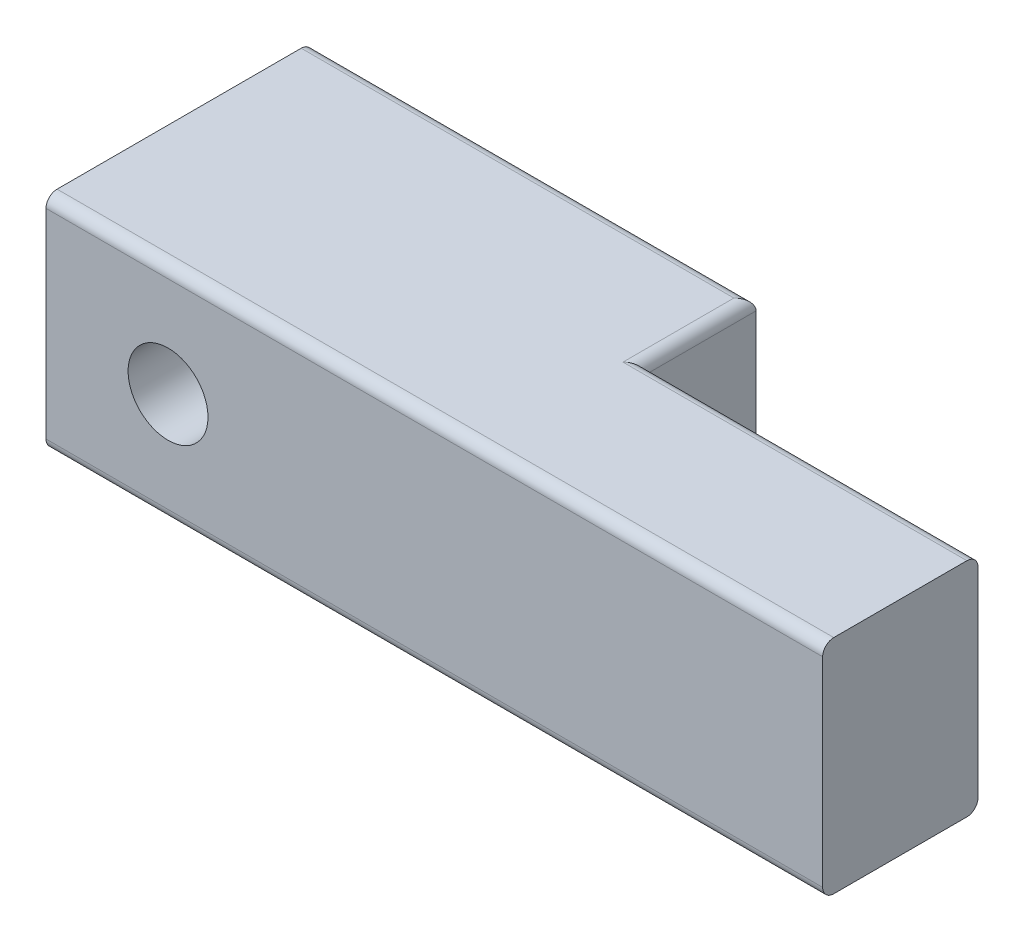
ISO-10303-21;
HEADER;
FILE_DESCRIPTION(('STEP AP214'),'2;1');
FILE_NAME('part.step','',(''),(''),'','','');
FILE_SCHEMA(('AUTOMOTIVE_DESIGN { 1 0 10303 214 1 1 1 1 }'));
ENDSEC;
DATA;
#1=APPLICATION_CONTEXT('core data for automotive mechanical design processes');
#2=APPLICATION_PROTOCOL_DEFINITION('international standard','automotive_design',2000,#1);
#3=PRODUCT_CONTEXT('',#1,'mechanical');
#4=PRODUCT('Part','Part','',(#3));
#5=PRODUCT_RELATED_PRODUCT_CATEGORY('part','',(#4));
#6=PRODUCT_DEFINITION_FORMATION('','',#4);
#7=PRODUCT_DEFINITION_CONTEXT('part definition',#1,'design');
#8=PRODUCT_DEFINITION('design','',#6,#7);
#9=PRODUCT_DEFINITION_SHAPE('','',#8);
#10=(LENGTH_UNIT() NAMED_UNIT(*) SI_UNIT(.MILLI.,.METRE.));
#11=(NAMED_UNIT(*) PLANE_ANGLE_UNIT() SI_UNIT($,.RADIAN.));
#12=(NAMED_UNIT(*) SI_UNIT($,.STERADIAN.) SOLID_ANGLE_UNIT());
#13=UNCERTAINTY_MEASURE_WITH_UNIT(LENGTH_MEASURE(1.E-05),#10,'distance_accuracy_value','');
#14=(GEOMETRIC_REPRESENTATION_CONTEXT(3) GLOBAL_UNCERTAINTY_ASSIGNED_CONTEXT((#13)) GLOBAL_UNIT_ASSIGNED_CONTEXT((#10,
#11,#12)) REPRESENTATION_CONTEXT('',''));
#15=CARTESIAN_POINT('',(0.,0.,0.));
#16=DIRECTION('',(0.,0.,1.));
#17=DIRECTION('',(1.,0.,0.));
#18=AXIS2_PLACEMENT_3D('',#15,#16,#17);
#19=CARTESIAN_POINT('',(17.5,-5.,7.));
#20=DIRECTION('',(-1.,0.,0.));
#21=DIRECTION('',(0.,0.,1.));
#22=AXIS2_PLACEMENT_3D('',#19,#20,#21);
#23=PLANE('',#22);
#24=DIRECTION('',(0.,1.,0.));
#25=VECTOR('',#24,1.);
#26=CARTESIAN_POINT('',(17.5,-5.,0.));
#27=LINE('',#26,#25);
#28=CARTESIAN_POINT('',(17.5,-4.5,0.));
#29=VERTEX_POINT('',#28);
#30=CARTESIAN_POINT('',(17.5,4.5,0.));
#31=VERTEX_POINT('',#30);
#32=EDGE_CURVE('E205',#29,#31,#27,.T.);
#33=ORIENTED_EDGE('',*,*,#32,.T.);
#34=CARTESIAN_POINT('',(17.5,4.5,0.5));
#35=DIRECTION('',(-1.,0.,0.));
#36=DIRECTION('',(0.,0.,1.));
#37=AXIS2_PLACEMENT_3D('',#34,#35,#36);
#38=CIRCLE('',#37,0.5);
#39=CARTESIAN_POINT('',(17.5,5.,0.5));
#40=VERTEX_POINT('',#39);
#41=EDGE_CURVE('E269',#31,#40,#38,.F.);
#42=ORIENTED_EDGE('',*,*,#41,.T.);
#43=DIRECTION('',(0.,0.,-1.));
#44=VECTOR('',#43,1.);
#45=CARTESIAN_POINT('',(17.5,5.,7.));
#46=LINE('',#45,#44);
#47=CARTESIAN_POINT('',(17.5,5.,6.5));
#48=VERTEX_POINT('',#47);
#49=EDGE_CURVE('E145',#48,#40,#46,.T.);
#50=ORIENTED_EDGE('',*,*,#49,.F.);
#51=CARTESIAN_POINT('',(17.5,4.5,6.5));
#52=DIRECTION('',(-1.,0.,0.));
#53=DIRECTION('',(0.,0.,1.));
#54=AXIS2_PLACEMENT_3D('',#51,#52,#53);
#55=CIRCLE('',#54,0.5);
#56=CARTESIAN_POINT('',(17.5,4.5,7.));
#57=VERTEX_POINT('',#56);
#58=EDGE_CURVE('E260',#48,#57,#55,.F.);
#59=ORIENTED_EDGE('',*,*,#58,.T.);
#60=DIRECTION('',(0.,1.,0.));
#61=VECTOR('',#60,1.);
#62=CARTESIAN_POINT('',(17.5,-5.,7.));
#63=LINE('',#62,#61);
#64=CARTESIAN_POINT('',(17.5,-4.5,7.));
#65=VERTEX_POINT('',#64);
#66=EDGE_CURVE('E209',#65,#57,#63,.T.);
#67=ORIENTED_EDGE('',*,*,#66,.F.);
#68=CARTESIAN_POINT('',(17.5,-4.5,6.5));
#69=DIRECTION('',(-1.,0.,0.));
#70=DIRECTION('',(0.,0.,1.));
#71=AXIS2_PLACEMENT_3D('',#68,#69,#70);
#72=CIRCLE('',#71,0.5);
#73=CARTESIAN_POINT('',(17.5,-5.,6.5));
#74=VERTEX_POINT('',#73);
#75=EDGE_CURVE('E263',#65,#74,#72,.F.);
#76=ORIENTED_EDGE('',*,*,#75,.T.);
#77=DIRECTION('',(0.,0.,-1.));
#78=VECTOR('',#77,1.);
#79=CARTESIAN_POINT('',(17.5,-5.,7.));
#80=LINE('',#79,#78);
#81=CARTESIAN_POINT('',(17.5,-5.,0.5));
#82=VERTEX_POINT('',#81);
#83=EDGE_CURVE('E141',#74,#82,#80,.T.);
#84=ORIENTED_EDGE('',*,*,#83,.T.);
#85=CARTESIAN_POINT('',(17.5,-4.5,0.5));
#86=DIRECTION('',(-1.,0.,0.));
#87=DIRECTION('',(0.,0.,1.));
#88=AXIS2_PLACEMENT_3D('',#85,#86,#87);
#89=CIRCLE('',#88,0.5);
#90=EDGE_CURVE('E266',#82,#29,#89,.F.);
#91=ORIENTED_EDGE('',*,*,#90,.T.);
#92=EDGE_LOOP('',(#33,#42,#50,#59,#67,#76,#84,#91));
#93=FACE_BOUND('',#92,.T.);
#94=ADVANCED_FACE('F39',(#93),#23,.F.);
#95=CARTESIAN_POINT('',(-17.5,5.,7.));
#96=DIRECTION('',(0.,-1.,0.));
#97=DIRECTION('',(0.,0.,-1.));
#98=AXIS2_PLACEMENT_3D('',#95,#96,#97);
#99=PLANE('',#98);
#100=ORIENTED_EDGE('',*,*,#49,.T.);
#101=DIRECTION('',(-1.,0.,0.));
#102=VECTOR('',#101,1.);
#103=CARTESIAN_POINT('',(2.5,5.,0.5));
#104=LINE('',#103,#102);
#105=CARTESIAN_POINT('',(2.,5.,0.5));
#106=VERTEX_POINT('',#105);
#107=EDGE_CURVE('E251',#40,#106,#104,.T.);
#108=ORIENTED_EDGE('',*,*,#107,.T.);
#109=DIRECTION('',(0.,0.,1.));
#110=VECTOR('',#109,1.);
#111=CARTESIAN_POINT('',(1.99999999999999,5.,7.));
#112=LINE('',#111,#110);
#113=CARTESIAN_POINT('',(2.,5.,-4.5));
#114=VERTEX_POINT('',#113);
#115=EDGE_CURVE('E248',#106,#114,#112,.F.);
#116=ORIENTED_EDGE('',*,*,#115,.T.);
#117=DIRECTION('',(1.,0.,0.));
#118=VECTOR('',#117,1.);
#119=CARTESIAN_POINT('',(-17.5,5.,-4.5));
#120=LINE('',#119,#118);
#121=CARTESIAN_POINT('',(-17.5,5.,-4.5));
#122=VERTEX_POINT('',#121);
#123=EDGE_CURVE('E245',#114,#122,#120,.F.);
#124=ORIENTED_EDGE('',*,*,#123,.T.);
#125=DIRECTION('',(0.,0.,-1.));
#126=VECTOR('',#125,1.);
#127=CARTESIAN_POINT('',(-17.5,5.,7.));
#128=LINE('',#127,#126);
#129=CARTESIAN_POINT('',(-17.5,5.,6.5));
#130=VERTEX_POINT('',#129);
#131=EDGE_CURVE('E152',#130,#122,#128,.T.);
#132=ORIENTED_EDGE('',*,*,#131,.F.);
#133=DIRECTION('',(-1.,0.,0.));
#134=VECTOR('',#133,1.);
#135=CARTESIAN_POINT('',(-17.5,5.,6.5));
#136=LINE('',#135,#134);
#137=EDGE_CURVE('E242',#130,#48,#136,.F.);
#138=ORIENTED_EDGE('',*,*,#137,.T.);
#139=EDGE_LOOP('',(#100,#108,#116,#124,#132,#138));
#140=FACE_BOUND('',#139,.T.);
#141=ADVANCED_FACE('F312',(#140),#99,.F.);
#142=CARTESIAN_POINT('',(-17.5,-5.,7.));
#143=DIRECTION('',(1.,0.,0.));
#144=DIRECTION('',(0.,0.,-1.));
#145=AXIS2_PLACEMENT_3D('',#142,#143,#144);
#146=PLANE('',#145);
#147=DIRECTION('',(0.,1.,0.));
#148=VECTOR('',#147,1.);
#149=CARTESIAN_POINT('',(-17.5,5.,-5.));
#150=LINE('',#149,#148);
#151=CARTESIAN_POINT('',(-17.5,-4.5,-5.));
#152=VERTEX_POINT('',#151);
#153=CARTESIAN_POINT('',(-17.5,4.5,-5.));
#154=VERTEX_POINT('',#153);
#155=EDGE_CURVE('E197',#152,#154,#150,.T.);
#156=ORIENTED_EDGE('',*,*,#155,.F.);
#157=CARTESIAN_POINT('',(-17.5,-4.5,-4.5));
#158=DIRECTION('',(1.,0.,0.));
#159=DIRECTION('',(0.,0.,-1.));
#160=AXIS2_PLACEMENT_3D('',#157,#158,#159);
#161=CIRCLE('',#160,0.5);
#162=CARTESIAN_POINT('',(-17.5,-5.,-4.5));
#163=VERTEX_POINT('',#162);
#164=EDGE_CURVE('E150',#152,#163,#161,.F.);
#165=ORIENTED_EDGE('',*,*,#164,.T.);
#166=DIRECTION('',(0.,0.,-1.));
#167=VECTOR('',#166,1.);
#168=CARTESIAN_POINT('',(-17.5,-5.,7.));
#169=LINE('',#168,#167);
#170=CARTESIAN_POINT('',(-17.5,-5.,6.5));
#171=VERTEX_POINT('',#170);
#172=EDGE_CURVE('E138',#171,#163,#169,.T.);
#173=ORIENTED_EDGE('',*,*,#172,.F.);
#174=CARTESIAN_POINT('',(-17.5,-4.5,6.5));
#175=DIRECTION('',(1.,0.,0.));
#176=DIRECTION('',(0.,0.,-1.));
#177=AXIS2_PLACEMENT_3D('',#174,#175,#176);
#178=CIRCLE('',#177,0.5);
#179=CARTESIAN_POINT('',(-17.5,-4.5,7.));
#180=VERTEX_POINT('',#179);
#181=EDGE_CURVE('E57',#171,#180,#178,.F.);
#182=ORIENTED_EDGE('',*,*,#181,.T.);
#183=DIRECTION('',(0.,-1.,0.));
#184=VECTOR('',#183,1.);
#185=CARTESIAN_POINT('',(-17.5,-5.,7.));
#186=LINE('',#185,#184);
#187=CARTESIAN_POINT('',(-17.5,4.5,7.));
#188=VERTEX_POINT('',#187);
#189=EDGE_CURVE('E213',#188,#180,#186,.T.);
#190=ORIENTED_EDGE('',*,*,#189,.F.);
#191=CARTESIAN_POINT('',(-17.5,4.5,6.5));
#192=DIRECTION('',(1.,0.,0.));
#193=DIRECTION('',(0.,0.,-1.));
#194=AXIS2_PLACEMENT_3D('',#191,#192,#193);
#195=CIRCLE('',#194,0.5);
#196=EDGE_CURVE('E65',#188,#130,#195,.F.);
#197=ORIENTED_EDGE('',*,*,#196,.T.);
#198=ORIENTED_EDGE('',*,*,#131,.T.);
#199=CARTESIAN_POINT('',(-17.5,4.5,-4.5));
#200=DIRECTION('',(1.,0.,0.));
#201=DIRECTION('',(0.,0.,-1.));
#202=AXIS2_PLACEMENT_3D('',#199,#200,#201);
#203=CIRCLE('',#202,0.5);
#204=EDGE_CURVE('E157',#122,#154,#203,.F.);
#205=ORIENTED_EDGE('',*,*,#204,.T.);
#206=EDGE_LOOP('',(#156,#165,#173,#182,#190,#197,#198,#205));
#207=FACE_BOUND('',#206,.T.);
#208=ADVANCED_FACE('F148',(#207),#146,.F.);
#209=CARTESIAN_POINT('',(-17.5,-5.,7.));
#210=DIRECTION('',(0.,1.,0.));
#211=DIRECTION('',(0.,0.,1.));
#212=AXIS2_PLACEMENT_3D('',#209,#210,#211);
#213=PLANE('',#212);
#214=DIRECTION('',(0.,0.,1.));
#215=VECTOR('',#214,1.);
#216=CARTESIAN_POINT('',(1.99999999999999,-5.,7.));
#217=LINE('',#216,#215);
#218=CARTESIAN_POINT('',(1.99999999999999,-5.,-4.5));
#219=VERTEX_POINT('',#218);
#220=CARTESIAN_POINT('',(1.99999999999999,-5.,0.5));
#221=VERTEX_POINT('',#220);
#222=EDGE_CURVE('E229',#219,#221,#217,.T.);
#223=ORIENTED_EDGE('',*,*,#222,.T.);
#224=DIRECTION('',(1.,0.,0.));
#225=VECTOR('',#224,1.);
#226=CARTESIAN_POINT('',(17.5,-5.,0.5));
#227=LINE('',#226,#225);
#228=EDGE_CURVE('E232',#221,#82,#227,.T.);
#229=ORIENTED_EDGE('',*,*,#228,.T.);
#230=ORIENTED_EDGE('',*,*,#83,.F.);
#231=DIRECTION('',(1.,0.,0.));
#232=VECTOR('',#231,1.);
#233=CARTESIAN_POINT('',(-17.5,-5.,6.5));
#234=LINE('',#233,#232);
#235=EDGE_CURVE('E135',#74,#171,#234,.F.);
#236=ORIENTED_EDGE('',*,*,#235,.T.);
#237=ORIENTED_EDGE('',*,*,#172,.T.);
#238=DIRECTION('',(-1.,0.,0.));
#239=VECTOR('',#238,1.);
#240=CARTESIAN_POINT('',(-17.5,-5.,-4.5));
#241=LINE('',#240,#239);
#242=EDGE_CURVE('E144',#163,#219,#241,.F.);
#243=ORIENTED_EDGE('',*,*,#242,.T.);
#244=EDGE_LOOP('',(#223,#229,#230,#236,#237,#243));
#245=FACE_BOUND('',#244,.T.);
#246=ADVANCED_FACE('F137',(#245),#213,.F.);
#247=CARTESIAN_POINT('',(0.,0.,7.));
#248=DIRECTION('',(0.,0.,-1.));
#249=DIRECTION('',(-1.,0.,0.));
#250=AXIS2_PLACEMENT_3D('',#247,#248,#249);
#251=PLANE('',#250);
#252=CARTESIAN_POINT('',(-12.,0.,7.));
#253=DIRECTION('',(0.,0.,1.));
#254=DIRECTION('',(1.,0.,0.));
#255=AXIS2_PLACEMENT_3D('',#252,#253,#254);
#256=CIRCLE('',#255,1.8);
#257=CARTESIAN_POINT('',(-10.2,0.,7.));
#258=VERTEX_POINT('',#257);
#259=EDGE_CURVE('E189',#258,#258,#256,.T.);
#260=ORIENTED_EDGE('',*,*,#259,.F.);
#261=EDGE_LOOP('',(#260));
#262=FACE_BOUND('',#261,.T.);
#263=ORIENTED_EDGE('',*,*,#189,.T.);
#264=DIRECTION('',(1.,0.,0.));
#265=VECTOR('',#264,1.);
#266=CARTESIAN_POINT('',(0.,-4.5,7.));
#267=LINE('',#266,#265);
#268=EDGE_CURVE('E11',#180,#65,#267,.T.);
#269=ORIENTED_EDGE('',*,*,#268,.T.);
#270=ORIENTED_EDGE('',*,*,#66,.T.);
#271=DIRECTION('',(-1.,0.,0.));
#272=VECTOR('',#271,1.);
#273=CARTESIAN_POINT('',(0.,4.5,7.));
#274=LINE('',#273,#272);
#275=EDGE_CURVE('E49',#57,#188,#274,.T.);
#276=ORIENTED_EDGE('',*,*,#275,.T.);
#277=EDGE_LOOP('',(#263,#269,#270,#276));
#278=FACE_BOUND('',#277,.T.);
#279=ADVANCED_FACE('F314',(#262,#278),#251,.F.);
#280=CARTESIAN_POINT('',(0.,0.,0.));
#281=DIRECTION('',(0.,0.,-1.));
#282=DIRECTION('',(-1.,0.,0.));
#283=AXIS2_PLACEMENT_3D('',#280,#281,#282);
#284=PLANE('',#283);
#285=DIRECTION('',(0.,-1.,0.));
#286=VECTOR('',#285,1.);
#287=CARTESIAN_POINT('',(2.5,5.,0.));
#288=LINE('',#287,#286);
#289=CARTESIAN_POINT('',(2.5,4.5,0.));
#290=VERTEX_POINT('',#289);
#291=CARTESIAN_POINT('',(2.5,-4.5,0.));
#292=VERTEX_POINT('',#291);
#293=EDGE_CURVE('E176',#290,#292,#288,.T.);
#294=ORIENTED_EDGE('',*,*,#293,.F.);
#295=DIRECTION('',(-1.,0.,0.));
#296=VECTOR('',#295,1.);
#297=CARTESIAN_POINT('',(17.5,4.5,0.));
#298=LINE('',#297,#296);
#299=EDGE_CURVE('E257',#290,#31,#298,.F.);
#300=ORIENTED_EDGE('',*,*,#299,.T.);
#301=ORIENTED_EDGE('',*,*,#32,.F.);
#302=DIRECTION('',(1.,0.,0.));
#303=VECTOR('',#302,1.);
#304=CARTESIAN_POINT('',(2.5,-4.5,0.));
#305=LINE('',#304,#303);
#306=EDGE_CURVE('E254',#29,#292,#305,.F.);
#307=ORIENTED_EDGE('',*,*,#306,.T.);
#308=EDGE_LOOP('',(#294,#300,#301,#307));
#309=FACE_BOUND('',#308,.T.);
#310=ADVANCED_FACE('F299',(#309),#284,.T.);
#311=CARTESIAN_POINT('',(2.5,5.,-5.));
#312=DIRECTION('',(-1.,0.,0.));
#313=DIRECTION('',(0.,0.,1.));
#314=AXIS2_PLACEMENT_3D('',#311,#312,#313);
#315=PLANE('',#314);
#316=ORIENTED_EDGE('',*,*,#293,.T.);
#317=DIRECTION('',(0.,0.,1.));
#318=VECTOR('',#317,1.);
#319=CARTESIAN_POINT('',(2.5,-4.5,-5.));
#320=LINE('',#319,#318);
#321=CARTESIAN_POINT('',(2.5,-4.5,-5.));
#322=VERTEX_POINT('',#321);
#323=EDGE_CURVE('E239',#292,#322,#320,.F.);
#324=ORIENTED_EDGE('',*,*,#323,.T.);
#325=DIRECTION('',(0.,-1.,0.));
#326=VECTOR('',#325,1.);
#327=CARTESIAN_POINT('',(2.5,5.,-5.));
#328=LINE('',#327,#326);
#329=CARTESIAN_POINT('',(2.5,4.5,-5.));
#330=VERTEX_POINT('',#329);
#331=EDGE_CURVE('E201',#330,#322,#328,.T.);
#332=ORIENTED_EDGE('',*,*,#331,.F.);
#333=DIRECTION('',(0.,0.,1.));
#334=VECTOR('',#333,1.);
#335=CARTESIAN_POINT('',(2.5,4.5,-5.));
#336=LINE('',#335,#334);
#337=EDGE_CURVE('E235',#330,#290,#336,.T.);
#338=ORIENTED_EDGE('',*,*,#337,.T.);
#339=EDGE_LOOP('',(#316,#324,#332,#338));
#340=FACE_BOUND('',#339,.T.);
#341=ADVANCED_FACE('F304',(#340),#315,.F.);
#342=CARTESIAN_POINT('',(0.,0.,-5.));
#343=DIRECTION('',(0.,0.,1.));
#344=DIRECTION('',(1.,0.,0.));
#345=AXIS2_PLACEMENT_3D('',#342,#343,#344);
#346=PLANE('',#345);
#347=CARTESIAN_POINT('',(-12.,0.,-5.));
#348=DIRECTION('',(0.,0.,1.));
#349=DIRECTION('',(1.,0.,0.));
#350=AXIS2_PLACEMENT_3D('',#347,#348,#349);
#351=CIRCLE('',#350,1.8);
#352=CARTESIAN_POINT('',(-10.2,0.,-5.));
#353=VERTEX_POINT('',#352);
#354=EDGE_CURVE('E179',#353,#353,#351,.T.);
#355=ORIENTED_EDGE('',*,*,#354,.T.);
#356=EDGE_LOOP('',(#355));
#357=FACE_BOUND('',#356,.T.);
#358=ORIENTED_EDGE('',*,*,#331,.T.);
#359=DIRECTION('',(-1.,0.,0.));
#360=VECTOR('',#359,1.);
#361=CARTESIAN_POINT('',(0.,-4.5,-5.));
#362=LINE('',#361,#360);
#363=EDGE_CURVE('E162',#322,#152,#362,.T.);
#364=ORIENTED_EDGE('',*,*,#363,.T.);
#365=ORIENTED_EDGE('',*,*,#155,.T.);
#366=DIRECTION('',(1.,0.,0.));
#367=VECTOR('',#366,1.);
#368=CARTESIAN_POINT('',(0.,4.5,-5.));
#369=LINE('',#368,#367);
#370=EDGE_CURVE('E272',#154,#330,#369,.T.);
#371=ORIENTED_EDGE('',*,*,#370,.T.);
#372=EDGE_LOOP('',(#358,#364,#365,#371));
#373=FACE_BOUND('',#372,.T.);
#374=ADVANCED_FACE('F277',(#357,#373),#346,.F.);
#375=CARTESIAN_POINT('',(0.,-4.5,-4.5));
#376=DIRECTION('',(-1.,0.,0.));
#377=DIRECTION('',(0.,0.,1.));
#378=AXIS2_PLACEMENT_3D('',#375,#376,#377);
#379=CYLINDRICAL_SURFACE('',#378,0.5);
#380=ORIENTED_EDGE('',*,*,#164,.F.);
#381=ORIENTED_EDGE('',*,*,#363,.F.);
#382=CARTESIAN_POINT('',(1.99999999999999,-4.5,-4.5));
#383=DIRECTION('',(-0.707106781186547,0.,-0.707106781186547));
#384=DIRECTION('',(-0.707106781186547,0.,0.707106781186547));
#385=AXIS2_PLACEMENT_3D('',#382,#383,#384);
#386=ELLIPSE('',#385,0.707106781186547,0.5);
#387=EDGE_CURVE('E173',#219,#322,#386,.F.);
#388=ORIENTED_EDGE('',*,*,#387,.F.);
#389=ORIENTED_EDGE('',*,*,#242,.F.);
#390=EDGE_LOOP('',(#380,#381,#388,#389));
#391=FACE_BOUND('',#390,.T.);
#392=ADVANCED_FACE('F283',(#391),#379,.T.);
#393=CARTESIAN_POINT('',(-17.5,-4.5,0.5));
#394=DIRECTION('',(-1.,0.,0.));
#395=DIRECTION('',(0.,0.,1.));
#396=AXIS2_PLACEMENT_3D('',#393,#394,#395);
#397=CYLINDRICAL_SURFACE('',#396,0.5);
#398=ORIENTED_EDGE('',*,*,#90,.F.);
#399=ORIENTED_EDGE('',*,*,#228,.F.);
#400=CARTESIAN_POINT('',(1.99999999999999,-4.5,0.5));
#401=DIRECTION('',(0.707106781186547,0.,0.707106781186547));
#402=DIRECTION('',(-0.707106781186547,0.,0.707106781186547));
#403=AXIS2_PLACEMENT_3D('',#400,#401,#402);
#404=ELLIPSE('',#403,0.707106781186547,0.5);
#405=EDGE_CURVE('E170',#292,#221,#404,.F.);
#406=ORIENTED_EDGE('',*,*,#405,.F.);
#407=ORIENTED_EDGE('',*,*,#306,.F.);
#408=EDGE_LOOP('',(#398,#399,#406,#407));
#409=FACE_BOUND('',#408,.T.);
#410=ADVANCED_FACE('F293',(#409),#397,.T.);
#411=CARTESIAN_POINT('',(1.99999999999999,-4.5,7.));
#412=DIRECTION('',(0.,0.,1.));
#413=DIRECTION('',(1.,0.,0.));
#414=AXIS2_PLACEMENT_3D('',#411,#412,#413);
#415=CYLINDRICAL_SURFACE('',#414,0.5);
#416=ORIENTED_EDGE('',*,*,#387,.T.);
#417=ORIENTED_EDGE('',*,*,#323,.F.);
#418=ORIENTED_EDGE('',*,*,#405,.T.);
#419=ORIENTED_EDGE('',*,*,#222,.F.);
#420=EDGE_LOOP('',(#416,#417,#418,#419));
#421=FACE_BOUND('',#420,.T.);
#422=ADVANCED_FACE('F287',(#421),#415,.T.);
#423=CARTESIAN_POINT('',(0.,4.5,-4.5));
#424=DIRECTION('',(1.,0.,0.));
#425=DIRECTION('',(0.,0.,-1.));
#426=AXIS2_PLACEMENT_3D('',#423,#424,#425);
#427=CYLINDRICAL_SURFACE('',#426,0.5);
#428=ORIENTED_EDGE('',*,*,#204,.F.);
#429=ORIENTED_EDGE('',*,*,#123,.F.);
#430=CARTESIAN_POINT('',(2.,4.5,-4.5));
#431=DIRECTION('',(0.707106781186547,0.,0.707106781186547));
#432=DIRECTION('',(0.707106781186547,0.,-0.707106781186547));
#433=AXIS2_PLACEMENT_3D('',#430,#431,#432);
#434=ELLIPSE('',#433,0.707106781186547,0.5);
#435=EDGE_CURVE('E43',#330,#114,#434,.T.);
#436=ORIENTED_EDGE('',*,*,#435,.F.);
#437=ORIENTED_EDGE('',*,*,#370,.F.);
#438=EDGE_LOOP('',(#428,#429,#436,#437));
#439=FACE_BOUND('',#438,.T.);
#440=ADVANCED_FACE('F309',(#439),#427,.T.);
#441=CARTESIAN_POINT('',(-17.5,4.5,0.5));
#442=DIRECTION('',(1.,0.,0.));
#443=DIRECTION('',(0.,0.,-1.));
#444=AXIS2_PLACEMENT_3D('',#441,#442,#443);
#445=CYLINDRICAL_SURFACE('',#444,0.5);
#446=ORIENTED_EDGE('',*,*,#41,.F.);
#447=ORIENTED_EDGE('',*,*,#299,.F.);
#448=CARTESIAN_POINT('',(1.99999999999999,4.5,0.5));
#449=DIRECTION('',(0.707106781186547,0.,0.707106781186547));
#450=DIRECTION('',(-0.707106781186547,0.,0.707106781186547));
#451=AXIS2_PLACEMENT_3D('',#448,#449,#450);
#452=ELLIPSE('',#451,0.707106781186547,0.5);
#453=EDGE_CURVE('E177',#106,#290,#452,.F.);
#454=ORIENTED_EDGE('',*,*,#453,.F.);
#455=ORIENTED_EDGE('',*,*,#107,.F.);
#456=EDGE_LOOP('',(#446,#447,#454,#455));
#457=FACE_BOUND('',#456,.T.);
#458=ADVANCED_FACE('F301',(#457),#445,.T.);
#459=CARTESIAN_POINT('',(2.,4.5,-5.));
#460=DIRECTION('',(0.,0.,1.));
#461=DIRECTION('',(1.,0.,0.));
#462=AXIS2_PLACEMENT_3D('',#459,#460,#461);
#463=CYLINDRICAL_SURFACE('',#462,0.5);
#464=ORIENTED_EDGE('',*,*,#435,.T.);
#465=ORIENTED_EDGE('',*,*,#115,.F.);
#466=ORIENTED_EDGE('',*,*,#453,.T.);
#467=ORIENTED_EDGE('',*,*,#337,.F.);
#468=EDGE_LOOP('',(#464,#465,#466,#467));
#469=FACE_BOUND('',#468,.T.);
#470=ADVANCED_FACE('F306',(#469),#463,.T.);
#471=CARTESIAN_POINT('',(0.,-4.5,6.5));
#472=DIRECTION('',(1.,0.,0.));
#473=DIRECTION('',(0.,0.,-1.));
#474=AXIS2_PLACEMENT_3D('',#471,#472,#473);
#475=CYLINDRICAL_SURFACE('',#474,0.5);
#476=ORIENTED_EDGE('',*,*,#181,.F.);
#477=ORIENTED_EDGE('',*,*,#235,.F.);
#478=ORIENTED_EDGE('',*,*,#75,.F.);
#479=ORIENTED_EDGE('',*,*,#268,.F.);
#480=EDGE_LOOP('',(#476,#477,#478,#479));
#481=FACE_BOUND('',#480,.T.);
#482=ADVANCED_FACE('F155',(#481),#475,.T.);
#483=CARTESIAN_POINT('',(0.,4.5,6.5));
#484=DIRECTION('',(-1.,0.,0.));
#485=DIRECTION('',(0.,0.,1.));
#486=AXIS2_PLACEMENT_3D('',#483,#484,#485);
#487=CYLINDRICAL_SURFACE('',#486,0.5);
#488=ORIENTED_EDGE('',*,*,#58,.F.);
#489=ORIENTED_EDGE('',*,*,#137,.F.);
#490=ORIENTED_EDGE('',*,*,#196,.F.);
#491=ORIENTED_EDGE('',*,*,#275,.F.);
#492=EDGE_LOOP('',(#488,#489,#490,#491));
#493=FACE_BOUND('',#492,.T.);
#494=ADVANCED_FACE('F41',(#493),#487,.T.);
#495=CARTESIAN_POINT('',(-12.,0.,7.));
#496=DIRECTION('',(0.,0.,1.));
#497=DIRECTION('',(1.,0.,0.));
#498=AXIS2_PLACEMENT_3D('',#495,#496,#497);
#499=CYLINDRICAL_SURFACE('',#498,1.8);
#500=ORIENTED_EDGE('',*,*,#354,.F.);
#501=EDGE_LOOP('',(#500));
#502=FACE_BOUND('',#501,.T.);
#503=ORIENTED_EDGE('',*,*,#259,.T.);
#504=EDGE_LOOP('',(#503));
#505=FACE_BOUND('',#504,.T.);
#506=ADVANCED_FACE('F319',(#502,#505),#499,.F.);
#507=CLOSED_SHELL('',(#94,#141,#208,#246,#279,#310,#341,#374,#392,#410,#422,#440,#458,#470,#482,
#494,#506));
#508=MANIFOLD_SOLID_BREP('B2',#507);
#509=ADVANCED_BREP_SHAPE_REPRESENTATION('',(#18,#508),#14);
#510=SHAPE_DEFINITION_REPRESENTATION(#9,#509);
ENDSEC;
END-ISO-10303-21;
